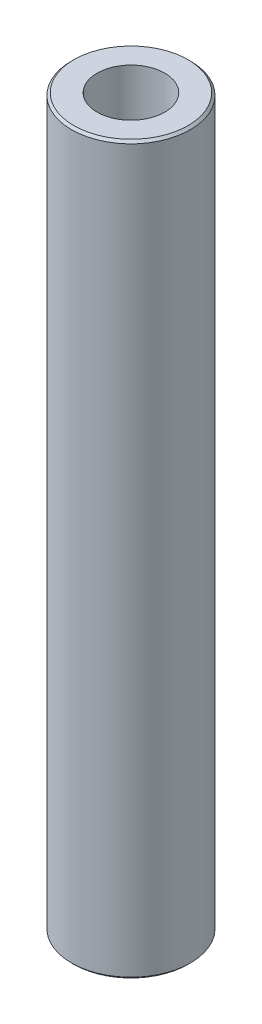
ISO-10303-21;
HEADER;
FILE_DESCRIPTION(('STEP AP214'),'2;1');
FILE_NAME('part.step','',(''),(''),'','','');
FILE_SCHEMA(('AUTOMOTIVE_DESIGN { 1 0 10303 214 1 1 1 1 }'));
ENDSEC;
DATA;
#1=APPLICATION_CONTEXT('core data for automotive mechanical design processes');
#2=APPLICATION_PROTOCOL_DEFINITION('international standard','automotive_design',2000,#1);
#3=PRODUCT_CONTEXT('',#1,'mechanical');
#4=PRODUCT('Part','Part','',(#3));
#5=PRODUCT_RELATED_PRODUCT_CATEGORY('part','',(#4));
#6=PRODUCT_DEFINITION_FORMATION('','',#4);
#7=PRODUCT_DEFINITION_CONTEXT('part definition',#1,'design');
#8=PRODUCT_DEFINITION('design','',#6,#7);
#9=PRODUCT_DEFINITION_SHAPE('','',#8);
#10=(LENGTH_UNIT() NAMED_UNIT(*) SI_UNIT(.MILLI.,.METRE.));
#11=(NAMED_UNIT(*) PLANE_ANGLE_UNIT() SI_UNIT($,.RADIAN.));
#12=(NAMED_UNIT(*) SI_UNIT($,.STERADIAN.) SOLID_ANGLE_UNIT());
#13=UNCERTAINTY_MEASURE_WITH_UNIT(LENGTH_MEASURE(1.E-05),#10,'distance_accuracy_value','');
#14=(GEOMETRIC_REPRESENTATION_CONTEXT(3) GLOBAL_UNCERTAINTY_ASSIGNED_CONTEXT((#13)) GLOBAL_UNIT_ASSIGNED_CONTEXT((#10,
#11,#12)) REPRESENTATION_CONTEXT('',''));
#15=CARTESIAN_POINT('',(0.,0.,0.));
#16=DIRECTION('',(0.,0.,1.));
#17=DIRECTION('',(1.,0.,0.));
#18=AXIS2_PLACEMENT_3D('',#15,#16,#17);
#19=CARTESIAN_POINT('',(0.,91.6175031004931,0.));
#20=DIRECTION('',(0.,-1.,0.));
#21=DIRECTION('',(0.,0.,-1.));
#22=AXIS2_PLACEMENT_3D('',#19,#20,#21);
#23=CYLINDRICAL_SURFACE('',#22,7.5);
#24=CARTESIAN_POINT('',(0.,91.3226787211791,0.));
#25=DIRECTION('',(0.,1.,0.));
#26=DIRECTION('',(0.,0.,1.));
#27=AXIS2_PLACEMENT_3D('',#24,#25,#26);
#28=CIRCLE('',#27,7.5);
#29=CARTESIAN_POINT('',(0.,91.3226787211791,7.5));
#30=VERTEX_POINT('',#29);
#31=EDGE_CURVE('E50',#30,#30,#28,.F.);
#32=ORIENTED_EDGE('',*,*,#31,.T.);
#33=EDGE_LOOP('',(#32));
#34=FACE_BOUND('',#33,.T.);
#35=CARTESIAN_POINT('',(0.,0.294824379313954,0.));
#36=DIRECTION('',(0.,1.,0.));
#37=DIRECTION('',(0.,0.,1.));
#38=AXIS2_PLACEMENT_3D('',#35,#36,#37);
#39=CIRCLE('',#38,7.5);
#40=CARTESIAN_POINT('',(0.,0.294824379313954,7.5));
#41=VERTEX_POINT('',#40);
#42=EDGE_CURVE('E51',#41,#41,#39,.T.);
#43=ORIENTED_EDGE('',*,*,#42,.T.);
#44=EDGE_LOOP('',(#43));
#45=FACE_BOUND('',#44,.T.);
#46=ADVANCED_FACE('F39',(#34,#45),#23,.T.);
#47=CARTESIAN_POINT('',(0.,91.6175031004931,0.));
#48=DIRECTION('',(0.,1.,0.));
#49=DIRECTION('',(0.,0.,1.));
#50=AXIS2_PLACEMENT_3D('',#47,#48,#49);
#51=PLANE('',#50);
#52=CARTESIAN_POINT('',(0.,91.6175031004931,0.));
#53=DIRECTION('',(0.,1.,0.));
#54=DIRECTION('',(0.,0.,1.));
#55=AXIS2_PLACEMENT_3D('',#52,#53,#54);
#56=CIRCLE('',#55,7.20517562068604);
#57=CARTESIAN_POINT('',(0.,91.6175031004931,7.20517562068604));
#58=VERTEX_POINT('',#57);
#59=EDGE_CURVE('E54',#58,#58,#56,.T.);
#60=ORIENTED_EDGE('',*,*,#59,.T.);
#61=EDGE_LOOP('',(#60));
#62=FACE_BOUND('',#61,.T.);
#63=CARTESIAN_POINT('',(0.,91.6175031004931,0.));
#64=DIRECTION('',(0.,1.,0.));
#65=DIRECTION('',(0.,0.,1.));
#66=AXIS2_PLACEMENT_3D('',#63,#64,#65);
#67=CIRCLE('',#66,4.26708209944742);
#68=CARTESIAN_POINT('',(0.,91.6175031004931,4.26708209944742));
#69=VERTEX_POINT('',#68);
#70=EDGE_CURVE('E58',#69,#69,#67,.T.);
#71=ORIENTED_EDGE('',*,*,#70,.F.);
#72=EDGE_LOOP('',(#71));
#73=FACE_BOUND('',#72,.T.);
#74=ADVANCED_FACE('F69',(#62,#73),#51,.T.);
#75=CARTESIAN_POINT('',(0.,0.,0.));
#76=DIRECTION('',(0.,1.,0.));
#77=DIRECTION('',(0.,0.,1.));
#78=AXIS2_PLACEMENT_3D('',#75,#76,#77);
#79=PLANE('',#78);
#80=CARTESIAN_POINT('',(0.,0.,0.));
#81=DIRECTION('',(0.,1.,0.));
#82=DIRECTION('',(0.,0.,1.));
#83=AXIS2_PLACEMENT_3D('',#80,#81,#82);
#84=CIRCLE('',#83,7.20517562068605);
#85=CARTESIAN_POINT('',(0.,0.,7.20517562068605));
#86=VERTEX_POINT('',#85);
#87=EDGE_CURVE('E10',#86,#86,#84,.F.);
#88=ORIENTED_EDGE('',*,*,#87,.T.);
#89=EDGE_LOOP('',(#88));
#90=FACE_BOUND('',#89,.T.);
#91=CARTESIAN_POINT('',(0.,0.,0.));
#92=DIRECTION('',(0.,1.,0.));
#93=DIRECTION('',(0.,0.,1.));
#94=AXIS2_PLACEMENT_3D('',#91,#92,#93);
#95=CIRCLE('',#94,4.26708209944742);
#96=CARTESIAN_POINT('',(0.,0.,4.26708209944742));
#97=VERTEX_POINT('',#96);
#98=EDGE_CURVE('E63',#97,#97,#95,.T.);
#99=ORIENTED_EDGE('',*,*,#98,.T.);
#100=EDGE_LOOP('',(#99));
#101=FACE_BOUND('',#100,.T.);
#102=ADVANCED_FACE('F75',(#90,#101),#79,.F.);
#103=CARTESIAN_POINT('',(0.,91.6175031004931,0.));
#104=DIRECTION('',(0.,-1.,0.));
#105=DIRECTION('',(0.,0.,-1.));
#106=AXIS2_PLACEMENT_3D('',#103,#104,#105);
#107=CYLINDRICAL_SURFACE('',#106,4.26708209944742);
#108=ORIENTED_EDGE('',*,*,#70,.T.);
#109=EDGE_LOOP('',(#108));
#110=FACE_BOUND('',#109,.T.);
#111=ORIENTED_EDGE('',*,*,#98,.F.);
#112=EDGE_LOOP('',(#111));
#113=FACE_BOUND('',#112,.T.);
#114=ADVANCED_FACE('F70',(#110,#113),#107,.F.);
#115=CARTESIAN_POINT('',(0.,91.6175031004931,0.));
#116=DIRECTION('',(0.,-1.,0.));
#117=DIRECTION('',(0.,0.,-1.));
#118=AXIS2_PLACEMENT_3D('',#115,#116,#117);
#119=CONICAL_SURFACE('',#118,7.20517562068604,0.785398163397437);
#120=ORIENTED_EDGE('',*,*,#31,.F.);
#121=EDGE_LOOP('',(#120));
#122=FACE_BOUND('',#121,.T.);
#123=ORIENTED_EDGE('',*,*,#59,.F.);
#124=EDGE_LOOP('',(#123));
#125=FACE_BOUND('',#124,.T.);
#126=ADVANCED_FACE('F81',(#122,#125),#119,.T.);
#127=CARTESIAN_POINT('',(0.,0.294824379313954,0.));
#128=DIRECTION('',(0.,1.,0.));
#129=DIRECTION('',(0.,0.,1.));
#130=AXIS2_PLACEMENT_3D('',#127,#128,#129);
#131=CONICAL_SURFACE('',#130,7.5,0.785398163397448);
#132=ORIENTED_EDGE('',*,*,#87,.F.);
#133=EDGE_LOOP('',(#132));
#134=FACE_BOUND('',#133,.T.);
#135=ORIENTED_EDGE('',*,*,#42,.F.);
#136=EDGE_LOOP('',(#135));
#137=FACE_BOUND('',#136,.T.);
#138=ADVANCED_FACE('F45',(#134,#137),#131,.T.);
#139=CLOSED_SHELL('',(#46,#74,#102,#114,#126,#138));
#140=MANIFOLD_SOLID_BREP('B2',#139);
#141=ADVANCED_BREP_SHAPE_REPRESENTATION('',(#18,#140),#14);
#142=SHAPE_DEFINITION_REPRESENTATION(#9,#141);
ENDSEC;
END-ISO-10303-21;
